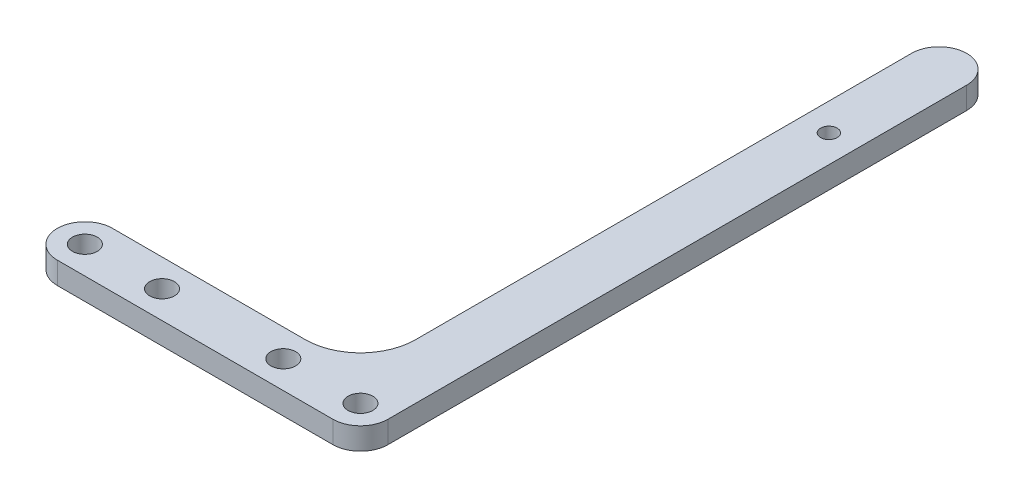
ISO-10303-21;
HEADER;
FILE_DESCRIPTION(('STEP AP214'),'2;1');
FILE_NAME('part.step','',(''),(''),'','','');
FILE_SCHEMA(('AUTOMOTIVE_DESIGN { 1 0 10303 214 1 1 1 1 }'));
ENDSEC;
DATA;
#1=APPLICATION_CONTEXT('core data for automotive mechanical design processes');
#2=APPLICATION_PROTOCOL_DEFINITION('international standard','automotive_design',2000,#1);
#3=PRODUCT_CONTEXT('',#1,'mechanical');
#4=PRODUCT('Part','Part','',(#3));
#5=PRODUCT_RELATED_PRODUCT_CATEGORY('part','',(#4));
#6=PRODUCT_DEFINITION_FORMATION('','',#4);
#7=PRODUCT_DEFINITION_CONTEXT('part definition',#1,'design');
#8=PRODUCT_DEFINITION('design','',#6,#7);
#9=PRODUCT_DEFINITION_SHAPE('','',#8);
#10=(LENGTH_UNIT() NAMED_UNIT(*) SI_UNIT(.MILLI.,.METRE.));
#11=(NAMED_UNIT(*) PLANE_ANGLE_UNIT() SI_UNIT($,.RADIAN.));
#12=(NAMED_UNIT(*) SI_UNIT($,.STERADIAN.) SOLID_ANGLE_UNIT());
#13=UNCERTAINTY_MEASURE_WITH_UNIT(LENGTH_MEASURE(1.E-05),#10,'distance_accuracy_value','');
#14=(GEOMETRIC_REPRESENTATION_CONTEXT(3) GLOBAL_UNCERTAINTY_ASSIGNED_CONTEXT((#13)) GLOBAL_UNIT_ASSIGNED_CONTEXT((#10,
#11,#12)) REPRESENTATION_CONTEXT('',''));
#15=CARTESIAN_POINT('',(0.,0.,0.));
#16=DIRECTION('',(0.,0.,1.));
#17=DIRECTION('',(1.,0.,0.));
#18=AXIS2_PLACEMENT_3D('',#15,#16,#17);
#19=CARTESIAN_POINT('',(5.00000000000001,4.,-100.));
#20=DIRECTION('',(0.,1.,0.));
#21=DIRECTION('',(0.,0.,1.));
#22=AXIS2_PLACEMENT_3D('',#19,#20,#21);
#23=PLANE('',#22);
#24=DIRECTION('',(1.,0.,0.));
#25=VECTOR('',#24,1.);
#26=CARTESIAN_POINT('',(0.,4.,9.99999999999999));
#27=LINE('',#26,#25);
#28=CARTESIAN_POINT('',(-45.,4.,10.));
#29=VERTEX_POINT('',#28);
#30=CARTESIAN_POINT('',(5.00000000000001,4.,9.99999999999999));
#31=VERTEX_POINT('',#30);
#32=EDGE_CURVE('E145',#29,#31,#27,.T.);
#33=ORIENTED_EDGE('',*,*,#32,.T.);
#34=CARTESIAN_POINT('',(5.00000000000001,4.,4.99999999999999));
#35=DIRECTION('',(0.,1.,0.));
#36=DIRECTION('',(0.,0.,1.));
#37=AXIS2_PLACEMENT_3D('',#34,#35,#36);
#38=CIRCLE('',#37,5.);
#39=CARTESIAN_POINT('',(10.,4.,4.99999999999999));
#40=VERTEX_POINT('',#39);
#41=EDGE_CURVE('E59',#31,#40,#38,.T.);
#42=ORIENTED_EDGE('',*,*,#41,.T.);
#43=DIRECTION('',(0.,0.,-1.));
#44=VECTOR('',#43,1.);
#45=CARTESIAN_POINT('',(10.,4.,-100.));
#46=LINE('',#45,#44);
#47=CARTESIAN_POINT('',(10.,4.,-100.));
#48=VERTEX_POINT('',#47);
#49=EDGE_CURVE('E156',#40,#48,#46,.T.);
#50=ORIENTED_EDGE('',*,*,#49,.T.);
#51=CARTESIAN_POINT('',(5.00000000000001,4.,-100.));
#52=DIRECTION('',(0.,1.,0.));
#53=DIRECTION('',(0.,0.,1.));
#54=AXIS2_PLACEMENT_3D('',#51,#52,#53);
#55=CIRCLE('',#54,5.);
#56=CARTESIAN_POINT('',(0.,4.,-100.));
#57=VERTEX_POINT('',#56);
#58=EDGE_CURVE('E158',#48,#57,#55,.T.);
#59=ORIENTED_EDGE('',*,*,#58,.T.);
#60=DIRECTION('',(0.,0.,1.));
#61=VECTOR('',#60,1.);
#62=CARTESIAN_POINT('',(0.,4.,0.));
#63=LINE('',#62,#61);
#64=CARTESIAN_POINT('',(0.,4.,-10.));
#65=VERTEX_POINT('',#64);
#66=EDGE_CURVE('E161',#57,#65,#63,.T.);
#67=ORIENTED_EDGE('',*,*,#66,.T.);
#68=CARTESIAN_POINT('',(-10.,4.,-10.));
#69=DIRECTION('',(0.,1.,0.));
#70=DIRECTION('',(0.,0.,1.));
#71=AXIS2_PLACEMENT_3D('',#68,#69,#70);
#72=CIRCLE('',#71,10.);
#73=CARTESIAN_POINT('',(-10.,4.,0.));
#74=VERTEX_POINT('',#73);
#75=EDGE_CURVE('E180',#65,#74,#72,.F.);
#76=ORIENTED_EDGE('',*,*,#75,.T.);
#77=DIRECTION('',(-1.,0.,0.));
#78=VECTOR('',#77,1.);
#79=CARTESIAN_POINT('',(0.,4.,0.));
#80=LINE('',#79,#78);
#81=CARTESIAN_POINT('',(-45.,4.,0.));
#82=VERTEX_POINT('',#81);
#83=EDGE_CURVE('E142',#74,#82,#80,.T.);
#84=ORIENTED_EDGE('',*,*,#83,.T.);
#85=CARTESIAN_POINT('',(-45.,4.,5.));
#86=DIRECTION('',(0.,1.,0.));
#87=DIRECTION('',(0.,0.,1.));
#88=AXIS2_PLACEMENT_3D('',#85,#86,#87);
#89=CIRCLE('',#88,5.);
#90=EDGE_CURVE('E118',#82,#29,#89,.T.);
#91=ORIENTED_EDGE('',*,*,#90,.T.);
#92=EDGE_LOOP('',(#33,#42,#50,#59,#67,#76,#84,#91));
#93=FACE_BOUND('',#92,.T.);
#94=CARTESIAN_POINT('',(5.00000000000001,4.,-80.));
#95=DIRECTION('',(0.,1.,0.));
#96=DIRECTION('',(0.,0.,1.));
#97=AXIS2_PLACEMENT_3D('',#94,#95,#96);
#98=CIRCLE('',#97,1.5);
#99=CARTESIAN_POINT('',(5.00000000000001,4.,-78.5));
#100=VERTEX_POINT('',#99);
#101=EDGE_CURVE('E150',#100,#100,#98,.T.);
#102=ORIENTED_EDGE('',*,*,#101,.F.);
#103=EDGE_LOOP('',(#102));
#104=FACE_BOUND('',#103,.T.);
#105=CARTESIAN_POINT('',(5.00000000000001,4.,5.));
#106=DIRECTION('',(0.,1.,0.));
#107=DIRECTION('',(0.,0.,1.));
#108=AXIS2_PLACEMENT_3D('',#105,#106,#107);
#109=CIRCLE('',#108,2.25);
#110=CARTESIAN_POINT('',(5.00000000000001,4.,7.25));
#111=VERTEX_POINT('',#110);
#112=EDGE_CURVE('E130',#111,#111,#109,.T.);
#113=ORIENTED_EDGE('',*,*,#112,.F.);
#114=EDGE_LOOP('',(#113));
#115=FACE_BOUND('',#114,.T.);
#116=CARTESIAN_POINT('',(-8.99999999999999,4.,5.));
#117=DIRECTION('',(0.,1.,0.));
#118=DIRECTION('',(0.,0.,1.));
#119=AXIS2_PLACEMENT_3D('',#116,#117,#118);
#120=CIRCLE('',#119,2.25);
#121=CARTESIAN_POINT('',(-8.99999999999999,4.,7.25));
#122=VERTEX_POINT('',#121);
#123=EDGE_CURVE('E133',#122,#122,#120,.T.);
#124=ORIENTED_EDGE('',*,*,#123,.F.);
#125=EDGE_LOOP('',(#124));
#126=FACE_BOUND('',#125,.T.);
#127=CARTESIAN_POINT('',(-31.,4.,5.));
#128=DIRECTION('',(0.,1.,0.));
#129=DIRECTION('',(0.,0.,1.));
#130=AXIS2_PLACEMENT_3D('',#127,#128,#129);
#131=CIRCLE('',#130,2.25);
#132=CARTESIAN_POINT('',(-31.,4.,7.25));
#133=VERTEX_POINT('',#132);
#134=EDGE_CURVE('E136',#133,#133,#131,.T.);
#135=ORIENTED_EDGE('',*,*,#134,.F.);
#136=EDGE_LOOP('',(#135));
#137=FACE_BOUND('',#136,.T.);
#138=CARTESIAN_POINT('',(-45.,4.,5.));
#139=DIRECTION('',(0.,1.,0.));
#140=DIRECTION('',(0.,0.,1.));
#141=AXIS2_PLACEMENT_3D('',#138,#139,#140);
#142=CIRCLE('',#141,2.25);
#143=CARTESIAN_POINT('',(-45.,4.,7.25));
#144=VERTEX_POINT('',#143);
#145=EDGE_CURVE('E139',#144,#144,#142,.T.);
#146=ORIENTED_EDGE('',*,*,#145,.F.);
#147=EDGE_LOOP('',(#146));
#148=FACE_BOUND('',#147,.T.);
#149=ADVANCED_FACE('F37',(#93,#104,#115,#126,#137,#148),#23,.T.);
#150=CARTESIAN_POINT('',(5.00000000000001,0.,-100.));
#151=DIRECTION('',(0.,1.,0.));
#152=DIRECTION('',(0.,0.,1.));
#153=AXIS2_PLACEMENT_3D('',#150,#151,#152);
#154=PLANE('',#153);
#155=DIRECTION('',(0.,0.,-1.));
#156=VECTOR('',#155,1.);
#157=CARTESIAN_POINT('',(10.,0.,-100.));
#158=LINE('',#157,#156);
#159=CARTESIAN_POINT('',(10.,0.,4.99999999999999));
#160=VERTEX_POINT('',#159);
#161=CARTESIAN_POINT('',(10.,0.,-100.));
#162=VERTEX_POINT('',#161);
#163=EDGE_CURVE('E153',#160,#162,#158,.T.);
#164=ORIENTED_EDGE('',*,*,#163,.F.);
#165=CARTESIAN_POINT('',(5.00000000000001,0.,4.99999999999999));
#166=DIRECTION('',(0.,1.,0.));
#167=DIRECTION('',(0.,0.,1.));
#168=AXIS2_PLACEMENT_3D('',#165,#166,#167);
#169=CIRCLE('',#168,5.);
#170=CARTESIAN_POINT('',(5.00000000000001,0.,9.99999999999999));
#171=VERTEX_POINT('',#170);
#172=EDGE_CURVE('E11',#160,#171,#169,.F.);
#173=ORIENTED_EDGE('',*,*,#172,.T.);
#174=DIRECTION('',(1.,0.,0.));
#175=VECTOR('',#174,1.);
#176=CARTESIAN_POINT('',(0.,0.,9.99999999999999));
#177=LINE('',#176,#175);
#178=CARTESIAN_POINT('',(-45.,0.,10.));
#179=VERTEX_POINT('',#178);
#180=EDGE_CURVE('E120',#179,#171,#177,.T.);
#181=ORIENTED_EDGE('',*,*,#180,.F.);
#182=CARTESIAN_POINT('',(-45.,0.,5.));
#183=DIRECTION('',(0.,1.,0.));
#184=DIRECTION('',(0.,0.,1.));
#185=AXIS2_PLACEMENT_3D('',#182,#183,#184);
#186=CIRCLE('',#185,5.);
#187=CARTESIAN_POINT('',(-45.,0.,0.));
#188=VERTEX_POINT('',#187);
#189=EDGE_CURVE('E111',#188,#179,#186,.T.);
#190=ORIENTED_EDGE('',*,*,#189,.F.);
#191=DIRECTION('',(-1.,0.,0.));
#192=VECTOR('',#191,1.);
#193=CARTESIAN_POINT('',(0.,0.,0.));
#194=LINE('',#193,#192);
#195=CARTESIAN_POINT('',(-10.,0.,0.));
#196=VERTEX_POINT('',#195);
#197=EDGE_CURVE('E101',#196,#188,#194,.T.);
#198=ORIENTED_EDGE('',*,*,#197,.F.);
#199=CARTESIAN_POINT('',(-10.,0.,-10.));
#200=DIRECTION('',(0.,1.,0.));
#201=DIRECTION('',(0.,0.,1.));
#202=AXIS2_PLACEMENT_3D('',#199,#200,#201);
#203=CIRCLE('',#202,10.);
#204=CARTESIAN_POINT('',(0.,0.,-10.));
#205=VERTEX_POINT('',#204);
#206=EDGE_CURVE('E178',#196,#205,#203,.T.);
#207=ORIENTED_EDGE('',*,*,#206,.T.);
#208=DIRECTION('',(0.,0.,1.));
#209=VECTOR('',#208,1.);
#210=CARTESIAN_POINT('',(0.,0.,0.));
#211=LINE('',#210,#209);
#212=CARTESIAN_POINT('',(0.,0.,-100.));
#213=VERTEX_POINT('',#212);
#214=EDGE_CURVE('E159',#213,#205,#211,.T.);
#215=ORIENTED_EDGE('',*,*,#214,.F.);
#216=CARTESIAN_POINT('',(5.00000000000001,0.,-100.));
#217=DIRECTION('',(0.,1.,0.));
#218=DIRECTION('',(0.,0.,1.));
#219=AXIS2_PLACEMENT_3D('',#216,#217,#218);
#220=CIRCLE('',#219,5.);
#221=EDGE_CURVE('E166',#162,#213,#220,.T.);
#222=ORIENTED_EDGE('',*,*,#221,.F.);
#223=EDGE_LOOP('',(#164,#173,#181,#190,#198,#207,#215,#222));
#224=FACE_BOUND('',#223,.T.);
#225=CARTESIAN_POINT('',(5.00000000000001,0.,-80.));
#226=DIRECTION('',(0.,1.,0.));
#227=DIRECTION('',(0.,0.,1.));
#228=AXIS2_PLACEMENT_3D('',#225,#226,#227);
#229=CIRCLE('',#228,1.5);
#230=CARTESIAN_POINT('',(5.00000000000001,0.,-78.5));
#231=VERTEX_POINT('',#230);
#232=EDGE_CURVE('E148',#231,#231,#229,.T.);
#233=ORIENTED_EDGE('',*,*,#232,.T.);
#234=EDGE_LOOP('',(#233));
#235=FACE_BOUND('',#234,.T.);
#236=CARTESIAN_POINT('',(5.00000000000001,0.,5.));
#237=DIRECTION('',(0.,1.,0.));
#238=DIRECTION('',(0.,0.,1.));
#239=AXIS2_PLACEMENT_3D('',#236,#237,#238);
#240=CIRCLE('',#239,2.25);
#241=CARTESIAN_POINT('',(5.00000000000001,0.,7.25));
#242=VERTEX_POINT('',#241);
#243=EDGE_CURVE('E147',#242,#242,#240,.T.);
#244=ORIENTED_EDGE('',*,*,#243,.T.);
#245=EDGE_LOOP('',(#244));
#246=FACE_BOUND('',#245,.T.);
#247=CARTESIAN_POINT('',(-8.99999999999999,0.,5.));
#248=DIRECTION('',(0.,1.,0.));
#249=DIRECTION('',(0.,0.,1.));
#250=AXIS2_PLACEMENT_3D('',#247,#248,#249);
#251=CIRCLE('',#250,2.25);
#252=CARTESIAN_POINT('',(-8.99999999999999,0.,7.25));
#253=VERTEX_POINT('',#252);
#254=EDGE_CURVE('E362',#253,#253,#251,.T.);
#255=ORIENTED_EDGE('',*,*,#254,.T.);
#256=EDGE_LOOP('',(#255));
#257=FACE_BOUND('',#256,.T.);
#258=CARTESIAN_POINT('',(-31.,0.,5.));
#259=DIRECTION('',(0.,1.,0.));
#260=DIRECTION('',(0.,0.,1.));
#261=AXIS2_PLACEMENT_3D('',#258,#259,#260);
#262=CIRCLE('',#261,2.25);
#263=CARTESIAN_POINT('',(-31.,0.,7.25));
#264=VERTEX_POINT('',#263);
#265=EDGE_CURVE('E365',#264,#264,#262,.T.);
#266=ORIENTED_EDGE('',*,*,#265,.T.);
#267=EDGE_LOOP('',(#266));
#268=FACE_BOUND('',#267,.T.);
#269=CARTESIAN_POINT('',(-45.,0.,5.));
#270=DIRECTION('',(0.,1.,0.));
#271=DIRECTION('',(0.,0.,1.));
#272=AXIS2_PLACEMENT_3D('',#269,#270,#271);
#273=CIRCLE('',#272,2.25);
#274=CARTESIAN_POINT('',(-45.,0.,7.25));
#275=VERTEX_POINT('',#274);
#276=EDGE_CURVE('E112',#275,#275,#273,.T.);
#277=ORIENTED_EDGE('',*,*,#276,.T.);
#278=EDGE_LOOP('',(#277));
#279=FACE_BOUND('',#278,.T.);
#280=ADVANCED_FACE('F123',(#224,#235,#246,#257,#268,#279),#154,.F.);
#281=CARTESIAN_POINT('',(10.,4.,-100.));
#282=DIRECTION('',(-1.,0.,0.));
#283=DIRECTION('',(0.,0.,1.));
#284=AXIS2_PLACEMENT_3D('',#281,#282,#283);
#285=PLANE('',#284);
#286=ORIENTED_EDGE('',*,*,#49,.F.);
#287=DIRECTION('',(0.,1.,0.));
#288=VECTOR('',#287,1.);
#289=CARTESIAN_POINT('',(10.,0.,4.99999999999999));
#290=LINE('',#289,#288);
#291=EDGE_CURVE('E45',#40,#160,#290,.F.);
#292=ORIENTED_EDGE('',*,*,#291,.T.);
#293=ORIENTED_EDGE('',*,*,#163,.T.);
#294=DIRECTION('',(0.,-1.,0.));
#295=VECTOR('',#294,1.);
#296=CARTESIAN_POINT('',(10.,4.,-100.));
#297=LINE('',#296,#295);
#298=EDGE_CURVE('E172',#48,#162,#297,.T.);
#299=ORIENTED_EDGE('',*,*,#298,.F.);
#300=EDGE_LOOP('',(#286,#292,#293,#299));
#301=FACE_BOUND('',#300,.T.);
#302=ADVANCED_FACE('F215',(#301),#285,.F.);
#303=CARTESIAN_POINT('',(5.00000000000001,4.,-100.));
#304=DIRECTION('',(0.,-1.,0.));
#305=DIRECTION('',(0.,0.,-1.));
#306=AXIS2_PLACEMENT_3D('',#303,#304,#305);
#307=CYLINDRICAL_SURFACE('',#306,5.);
#308=ORIENTED_EDGE('',*,*,#221,.T.);
#309=DIRECTION('',(0.,-1.,0.));
#310=VECTOR('',#309,1.);
#311=CARTESIAN_POINT('',(0.,4.,-100.));
#312=LINE('',#311,#310);
#313=EDGE_CURVE('E164',#57,#213,#312,.T.);
#314=ORIENTED_EDGE('',*,*,#313,.F.);
#315=ORIENTED_EDGE('',*,*,#58,.F.);
#316=ORIENTED_EDGE('',*,*,#298,.T.);
#317=EDGE_LOOP('',(#308,#314,#315,#316));
#318=FACE_BOUND('',#317,.T.);
#319=ADVANCED_FACE('F204',(#318),#307,.T.);
#320=CARTESIAN_POINT('',(0.,4.,0.));
#321=DIRECTION('',(1.,0.,0.));
#322=DIRECTION('',(0.,0.,-1.));
#323=AXIS2_PLACEMENT_3D('',#320,#321,#322);
#324=PLANE('',#323);
#325=ORIENTED_EDGE('',*,*,#214,.T.);
#326=DIRECTION('',(0.,-1.,0.));
#327=VECTOR('',#326,1.);
#328=CARTESIAN_POINT('',(0.,4.,-10.));
#329=LINE('',#328,#327);
#330=EDGE_CURVE('E176',#205,#65,#329,.F.);
#331=ORIENTED_EDGE('',*,*,#330,.T.);
#332=ORIENTED_EDGE('',*,*,#66,.F.);
#333=ORIENTED_EDGE('',*,*,#313,.T.);
#334=EDGE_LOOP('',(#325,#331,#332,#333));
#335=FACE_BOUND('',#334,.T.);
#336=ADVANCED_FACE('F199',(#335),#324,.F.);
#337=CARTESIAN_POINT('',(5.00000000000001,4.,-80.));
#338=DIRECTION('',(0.,-1.,0.));
#339=DIRECTION('',(0.,0.,-1.));
#340=AXIS2_PLACEMENT_3D('',#337,#338,#339);
#341=CYLINDRICAL_SURFACE('',#340,1.5);
#342=ORIENTED_EDGE('',*,*,#101,.T.);
#343=EDGE_LOOP('',(#342));
#344=FACE_BOUND('',#343,.T.);
#345=ORIENTED_EDGE('',*,*,#232,.F.);
#346=EDGE_LOOP('',(#345));
#347=FACE_BOUND('',#346,.T.);
#348=ADVANCED_FACE('F218',(#344,#347),#341,.F.);
#349=CARTESIAN_POINT('',(0.,0.,0.));
#350=DIRECTION('',(0.,0.,-1.));
#351=DIRECTION('',(-1.,0.,0.));
#352=AXIS2_PLACEMENT_3D('',#349,#350,#351);
#353=PLANE('',#352);
#354=ORIENTED_EDGE('',*,*,#83,.F.);
#355=DIRECTION('',(0.,-1.,0.));
#356=VECTOR('',#355,1.);
#357=CARTESIAN_POINT('',(-10.,0.,0.));
#358=LINE('',#357,#356);
#359=EDGE_CURVE('E108',#74,#196,#358,.T.);
#360=ORIENTED_EDGE('',*,*,#359,.T.);
#361=ORIENTED_EDGE('',*,*,#197,.T.);
#362=DIRECTION('',(0.,1.,0.));
#363=VECTOR('',#362,1.);
#364=CARTESIAN_POINT('',(-45.,0.,0.));
#365=LINE('',#364,#363);
#366=EDGE_CURVE('E105',#188,#82,#365,.T.);
#367=ORIENTED_EDGE('',*,*,#366,.T.);
#368=EDGE_LOOP('',(#354,#360,#361,#367));
#369=FACE_BOUND('',#368,.T.);
#370=ADVANCED_FACE('F104',(#369),#353,.T.);
#371=CARTESIAN_POINT('',(0.,0.,9.99999999999999));
#372=DIRECTION('',(0.,0.,1.));
#373=DIRECTION('',(1.,0.,0.));
#374=AXIS2_PLACEMENT_3D('',#371,#372,#373);
#375=PLANE('',#374);
#376=ORIENTED_EDGE('',*,*,#180,.T.);
#377=DIRECTION('',(0.,1.,0.));
#378=VECTOR('',#377,1.);
#379=CARTESIAN_POINT('',(5.00000000000001,4.,9.99999999999999));
#380=LINE('',#379,#378);
#381=EDGE_CURVE('E182',#171,#31,#380,.T.);
#382=ORIENTED_EDGE('',*,*,#381,.T.);
#383=ORIENTED_EDGE('',*,*,#32,.F.);
#384=DIRECTION('',(0.,1.,0.));
#385=VECTOR('',#384,1.);
#386=CARTESIAN_POINT('',(-45.,0.,10.));
#387=LINE('',#386,#385);
#388=EDGE_CURVE('E119',#179,#29,#387,.T.);
#389=ORIENTED_EDGE('',*,*,#388,.F.);
#390=EDGE_LOOP('',(#376,#382,#383,#389));
#391=FACE_BOUND('',#390,.T.);
#392=ADVANCED_FACE('F188',(#391),#375,.T.);
#393=CARTESIAN_POINT('',(-45.,0.,5.));
#394=DIRECTION('',(0.,1.,0.));
#395=DIRECTION('',(0.,0.,1.));
#396=AXIS2_PLACEMENT_3D('',#393,#394,#395);
#397=CYLINDRICAL_SURFACE('',#396,2.25);
#398=ORIENTED_EDGE('',*,*,#276,.F.);
#399=EDGE_LOOP('',(#398));
#400=FACE_BOUND('',#399,.T.);
#401=ORIENTED_EDGE('',*,*,#145,.T.);
#402=EDGE_LOOP('',(#401));
#403=FACE_BOUND('',#402,.T.);
#404=ADVANCED_FACE('F259',(#400,#403),#397,.F.);
#405=CARTESIAN_POINT('',(-31.,0.,5.));
#406=DIRECTION('',(0.,1.,0.));
#407=DIRECTION('',(0.,0.,1.));
#408=AXIS2_PLACEMENT_3D('',#405,#406,#407);
#409=CYLINDRICAL_SURFACE('',#408,2.25);
#410=ORIENTED_EDGE('',*,*,#265,.F.);
#411=EDGE_LOOP('',(#410));
#412=FACE_BOUND('',#411,.T.);
#413=ORIENTED_EDGE('',*,*,#134,.T.);
#414=EDGE_LOOP('',(#413));
#415=FACE_BOUND('',#414,.T.);
#416=ADVANCED_FACE('F265',(#412,#415),#409,.F.);
#417=CARTESIAN_POINT('',(-8.99999999999999,0.,5.));
#418=DIRECTION('',(0.,1.,0.));
#419=DIRECTION('',(0.,0.,1.));
#420=AXIS2_PLACEMENT_3D('',#417,#418,#419);
#421=CYLINDRICAL_SURFACE('',#420,2.25);
#422=ORIENTED_EDGE('',*,*,#254,.F.);
#423=EDGE_LOOP('',(#422));
#424=FACE_BOUND('',#423,.T.);
#425=ORIENTED_EDGE('',*,*,#123,.T.);
#426=EDGE_LOOP('',(#425));
#427=FACE_BOUND('',#426,.T.);
#428=ADVANCED_FACE('F273',(#424,#427),#421,.F.);
#429=CARTESIAN_POINT('',(5.00000000000001,0.,5.));
#430=DIRECTION('',(0.,1.,0.));
#431=DIRECTION('',(0.,0.,1.));
#432=AXIS2_PLACEMENT_3D('',#429,#430,#431);
#433=CYLINDRICAL_SURFACE('',#432,2.25);
#434=ORIENTED_EDGE('',*,*,#243,.F.);
#435=EDGE_LOOP('',(#434));
#436=FACE_BOUND('',#435,.T.);
#437=ORIENTED_EDGE('',*,*,#112,.T.);
#438=EDGE_LOOP('',(#437));
#439=FACE_BOUND('',#438,.T.);
#440=ADVANCED_FACE('F281',(#436,#439),#433,.F.);
#441=CARTESIAN_POINT('',(-45.,0.,5.));
#442=DIRECTION('',(0.,1.,0.));
#443=DIRECTION('',(0.,0.,1.));
#444=AXIS2_PLACEMENT_3D('',#441,#442,#443);
#445=CYLINDRICAL_SURFACE('',#444,5.);
#446=ORIENTED_EDGE('',*,*,#90,.F.);
#447=ORIENTED_EDGE('',*,*,#366,.F.);
#448=ORIENTED_EDGE('',*,*,#189,.T.);
#449=ORIENTED_EDGE('',*,*,#388,.T.);
#450=EDGE_LOOP('',(#446,#447,#448,#449));
#451=FACE_BOUND('',#450,.T.);
#452=ADVANCED_FACE('F116',(#451),#445,.T.);
#453=CARTESIAN_POINT('',(-10.,0.,-10.));
#454=DIRECTION('',(0.,-1.,0.));
#455=DIRECTION('',(0.,0.,-1.));
#456=AXIS2_PLACEMENT_3D('',#453,#454,#455);
#457=CYLINDRICAL_SURFACE('',#456,10.);
#458=ORIENTED_EDGE('',*,*,#75,.F.);
#459=ORIENTED_EDGE('',*,*,#330,.F.);
#460=ORIENTED_EDGE('',*,*,#206,.F.);
#461=ORIENTED_EDGE('',*,*,#359,.F.);
#462=EDGE_LOOP('',(#458,#459,#460,#461));
#463=FACE_BOUND('',#462,.T.);
#464=ADVANCED_FACE('F194',(#463),#457,.F.);
#465=CARTESIAN_POINT('',(5.00000000000001,0.,4.99999999999999));
#466=DIRECTION('',(0.,-1.,0.));
#467=DIRECTION('',(0.,0.,-1.));
#468=AXIS2_PLACEMENT_3D('',#465,#466,#467);
#469=CYLINDRICAL_SURFACE('',#468,5.);
#470=ORIENTED_EDGE('',*,*,#172,.F.);
#471=ORIENTED_EDGE('',*,*,#291,.F.);
#472=ORIENTED_EDGE('',*,*,#41,.F.);
#473=ORIENTED_EDGE('',*,*,#381,.F.);
#474=EDGE_LOOP('',(#470,#471,#472,#473));
#475=FACE_BOUND('',#474,.T.);
#476=ADVANCED_FACE('F39',(#475),#469,.T.);
#477=CLOSED_SHELL('',(#149,#280,#302,#319,#336,#348,#370,#392,#404,#416,#428,#440,#452,#464,#476));
#478=MANIFOLD_SOLID_BREP('B2',#477);
#479=ADVANCED_BREP_SHAPE_REPRESENTATION('',(#18,#478),#14);
#480=SHAPE_DEFINITION_REPRESENTATION(#9,#479);
ENDSEC;
END-ISO-10303-21;
